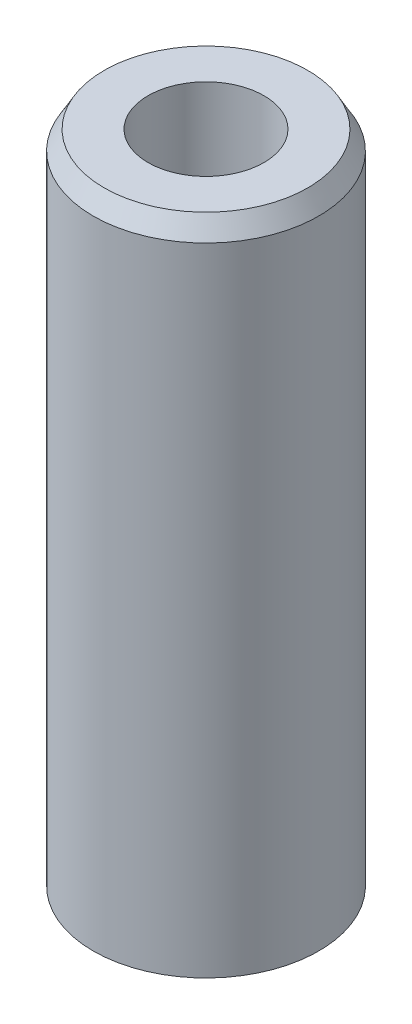
ISO-10303-21;
HEADER;
FILE_DESCRIPTION(('STEP AP214'),'2;1');
FILE_NAME('part.step','',(''),(''),'','','');
FILE_SCHEMA(('AUTOMOTIVE_DESIGN { 1 0 10303 214 1 1 1 1 }'));
ENDSEC;
DATA;
#1=APPLICATION_CONTEXT('core data for automotive mechanical design processes');
#2=APPLICATION_PROTOCOL_DEFINITION('international standard','automotive_design',2000,#1);
#3=PRODUCT_CONTEXT('',#1,'mechanical');
#4=PRODUCT('Part','Part','',(#3));
#5=PRODUCT_RELATED_PRODUCT_CATEGORY('part','',(#4));
#6=PRODUCT_DEFINITION_FORMATION('','',#4);
#7=PRODUCT_DEFINITION_CONTEXT('part definition',#1,'design');
#8=PRODUCT_DEFINITION('design','',#6,#7);
#9=PRODUCT_DEFINITION_SHAPE('','',#8);
#10=(LENGTH_UNIT() NAMED_UNIT(*) SI_UNIT(.MILLI.,.METRE.));
#11=(NAMED_UNIT(*) PLANE_ANGLE_UNIT() SI_UNIT($,.RADIAN.));
#12=(NAMED_UNIT(*) SI_UNIT($,.STERADIAN.) SOLID_ANGLE_UNIT());
#13=UNCERTAINTY_MEASURE_WITH_UNIT(LENGTH_MEASURE(1.E-05),#10,'distance_accuracy_value','');
#14=(GEOMETRIC_REPRESENTATION_CONTEXT(3) GLOBAL_UNCERTAINTY_ASSIGNED_CONTEXT((#13)) GLOBAL_UNIT_ASSIGNED_CONTEXT((#10,
#11,#12)) REPRESENTATION_CONTEXT('',''));
#15=CARTESIAN_POINT('',(0.,0.,0.));
#16=DIRECTION('',(0.,0.,1.));
#17=DIRECTION('',(1.,0.,0.));
#18=AXIS2_PLACEMENT_3D('',#15,#16,#17);
#19=CARTESIAN_POINT('',(0.,59.1041487479698,0.));
#20=DIRECTION('',(0.,-1.,0.));
#21=DIRECTION('',(0.,0.,-1.));
#22=AXIS2_PLACEMENT_3D('',#19,#20,#21);
#23=CYLINDRICAL_SURFACE('',#22,10.);
#24=CARTESIAN_POINT('',(0.,57.4228321711889,0.));
#25=DIRECTION('',(0.,1.,0.));
#26=DIRECTION('',(0.,0.,1.));
#27=AXIS2_PLACEMENT_3D('',#24,#25,#26);
#28=CIRCLE('',#27,10.);
#29=CARTESIAN_POINT('',(0.,57.4228321711889,10.));
#30=VERTEX_POINT('',#29);
#31=EDGE_CURVE('E50',#30,#30,#28,.F.);
#32=ORIENTED_EDGE('',*,*,#31,.T.);
#33=EDGE_LOOP('',(#32));
#34=FACE_BOUND('',#33,.T.);
#35=CARTESIAN_POINT('',(0.,0.970708578197428,0.));
#36=DIRECTION('',(0.,1.,0.));
#37=DIRECTION('',(0.,0.,1.));
#38=AXIS2_PLACEMENT_3D('',#35,#36,#37);
#39=CIRCLE('',#38,10.);
#40=CARTESIAN_POINT('',(0.,0.970708578197428,10.));
#41=VERTEX_POINT('',#40);
#42=EDGE_CURVE('E51',#41,#41,#39,.T.);
#43=ORIENTED_EDGE('',*,*,#42,.T.);
#44=EDGE_LOOP('',(#43));
#45=FACE_BOUND('',#44,.T.);
#46=ADVANCED_FACE('F39',(#34,#45),#23,.T.);
#47=CARTESIAN_POINT('',(0.,59.1041487479698,0.));
#48=DIRECTION('',(0.,1.,0.));
#49=DIRECTION('',(0.,0.,1.));
#50=AXIS2_PLACEMENT_3D('',#47,#48,#49);
#51=PLANE('',#50);
#52=CARTESIAN_POINT('',(0.,59.1041487479698,0.));
#53=DIRECTION('',(0.,1.,0.));
#54=DIRECTION('',(0.,0.,1.));
#55=AXIS2_PLACEMENT_3D('',#52,#53,#54);
#56=CIRCLE('',#55,9.02929142180256);
#57=CARTESIAN_POINT('',(0.,59.1041487479698,9.02929142180256));
#58=VERTEX_POINT('',#57);
#59=EDGE_CURVE('E54',#58,#58,#56,.T.);
#60=ORIENTED_EDGE('',*,*,#59,.T.);
#61=EDGE_LOOP('',(#60));
#62=FACE_BOUND('',#61,.T.);
#63=CARTESIAN_POINT('',(0.,59.1041487479698,0.));
#64=DIRECTION('',(0.,1.,0.));
#65=DIRECTION('',(0.,0.,1.));
#66=AXIS2_PLACEMENT_3D('',#63,#64,#65);
#67=CIRCLE('',#66,5.1433726205638);
#68=CARTESIAN_POINT('',(0.,59.1041487479698,5.1433726205638));
#69=VERTEX_POINT('',#68);
#70=EDGE_CURVE('E58',#69,#69,#67,.T.);
#71=ORIENTED_EDGE('',*,*,#70,.F.);
#72=EDGE_LOOP('',(#71));
#73=FACE_BOUND('',#72,.T.);
#74=ADVANCED_FACE('F69',(#62,#73),#51,.T.);
#75=CARTESIAN_POINT('',(0.,0.,0.));
#76=DIRECTION('',(0.,1.,0.));
#77=DIRECTION('',(0.,0.,1.));
#78=AXIS2_PLACEMENT_3D('',#75,#76,#77);
#79=PLANE('',#78);
#80=CARTESIAN_POINT('',(0.,0.,0.));
#81=DIRECTION('',(0.,1.,0.));
#82=DIRECTION('',(0.,0.,1.));
#83=AXIS2_PLACEMENT_3D('',#80,#81,#82);
#84=CIRCLE('',#83,8.3186834232191);
#85=CARTESIAN_POINT('',(0.,0.,8.3186834232191));
#86=VERTEX_POINT('',#85);
#87=EDGE_CURVE('E10',#86,#86,#84,.F.);
#88=ORIENTED_EDGE('',*,*,#87,.T.);
#89=EDGE_LOOP('',(#88));
#90=FACE_BOUND('',#89,.T.);
#91=CARTESIAN_POINT('',(0.,0.,0.));
#92=DIRECTION('',(0.,1.,0.));
#93=DIRECTION('',(0.,0.,1.));
#94=AXIS2_PLACEMENT_3D('',#91,#92,#93);
#95=CIRCLE('',#94,5.1433726205638);
#96=CARTESIAN_POINT('',(0.,0.,5.1433726205638));
#97=VERTEX_POINT('',#96);
#98=EDGE_CURVE('E63',#97,#97,#95,.T.);
#99=ORIENTED_EDGE('',*,*,#98,.T.);
#100=EDGE_LOOP('',(#99));
#101=FACE_BOUND('',#100,.T.);
#102=ADVANCED_FACE('F75',(#90,#101),#79,.F.);
#103=CARTESIAN_POINT('',(0.,59.1041487479698,0.));
#104=DIRECTION('',(0.,-1.,0.));
#105=DIRECTION('',(0.,0.,-1.));
#106=AXIS2_PLACEMENT_3D('',#103,#104,#105);
#107=CYLINDRICAL_SURFACE('',#106,5.1433726205638);
#108=ORIENTED_EDGE('',*,*,#70,.T.);
#109=EDGE_LOOP('',(#108));
#110=FACE_BOUND('',#109,.T.);
#111=ORIENTED_EDGE('',*,*,#98,.F.);
#112=EDGE_LOOP('',(#111));
#113=FACE_BOUND('',#112,.T.);
#114=ADVANCED_FACE('F70',(#110,#113),#107,.F.);
#115=CARTESIAN_POINT('',(0.,59.1041487479698,0.));
#116=DIRECTION('',(0.,-1.,0.));
#117=DIRECTION('',(0.,0.,-1.));
#118=AXIS2_PLACEMENT_3D('',#115,#116,#117);
#119=CONICAL_SURFACE('',#118,9.02929142180256,0.5235987755983);
#120=ORIENTED_EDGE('',*,*,#31,.F.);
#121=EDGE_LOOP('',(#120));
#122=FACE_BOUND('',#121,.T.);
#123=ORIENTED_EDGE('',*,*,#59,.F.);
#124=EDGE_LOOP('',(#123));
#125=FACE_BOUND('',#124,.T.);
#126=ADVANCED_FACE('F81',(#122,#125),#119,.T.);
#127=CARTESIAN_POINT('',(0.,0.970708578197428,0.));
#128=DIRECTION('',(0.,1.,0.));
#129=DIRECTION('',(0.,0.,1.));
#130=AXIS2_PLACEMENT_3D('',#127,#128,#129);
#131=CONICAL_SURFACE('',#130,10.,1.0471975511966);
#132=CARTESIAN_POINT('',(0.,0.,8.3186834232191));
#133=CARTESIAN_POINT('',(0.,0.0101115476895562,8.33619713756057));
#134=CARTESIAN_POINT('',(0.,0.0202230953791129,8.35371085190203));
#135=CARTESIAN_POINT('',(0.,0.0404461907582261,8.38873828058497));
#136=CARTESIAN_POINT('',(0.,0.0505577384477828,8.40625199492644));
#137=CARTESIAN_POINT('',(0.,0.0707808338268958,8.44127942360937));
#138=CARTESIAN_POINT('',(0.,0.0808923815164521,8.45879313795084));
#139=CARTESIAN_POINT('',(0.,0.101115476895565,8.49382056663378));
#140=CARTESIAN_POINT('',(0.,0.111227024585122,8.51133428097524));
#141=CARTESIAN_POINT('',(0.,0.131450119964235,8.54636170965818));
#142=CARTESIAN_POINT('',(0.,0.141561667653792,8.56387542399965));
#143=CARTESIAN_POINT('',(0.,0.161784763032905,8.59890285268258));
#144=CARTESIAN_POINT('',(0.,0.171896310722461,8.61641656702405));
#145=CARTESIAN_POINT('',(0.,0.192119406101574,8.65144399570699));
#146=CARTESIAN_POINT('',(0.,0.202230953791131,8.66895771004845));
#147=CARTESIAN_POINT('',(0.,0.222454049170244,8.70398513873139));
#148=CARTESIAN_POINT('',(0.,0.2325655968598,8.72149885307286));
#149=CARTESIAN_POINT('',(0.,0.252788692238913,8.75652628175579));
#150=CARTESIAN_POINT('',(0.,0.26290023992847,8.77403999609726));
#151=CARTESIAN_POINT('',(0.,0.283123335307583,8.8090674247802));
#152=CARTESIAN_POINT('',(0.,0.29323488299714,8.82658113912166));
#153=CARTESIAN_POINT('',(0.,0.313457978376253,8.8616085678046));
#154=CARTESIAN_POINT('',(0.,0.323569526065809,8.87912228214607));
#155=CARTESIAN_POINT('',(0.,0.343792621444922,8.914149710829));
#156=CARTESIAN_POINT('',(0.,0.353904169134479,8.93166342517047));
#157=CARTESIAN_POINT('',(0.,0.374127264513592,8.9666908538534));
#158=CARTESIAN_POINT('',(0.,0.384238812203149,8.98420456819487));
#159=CARTESIAN_POINT('',(0.,0.404461907582262,9.01923199687781));
#160=CARTESIAN_POINT('',(0.,0.414573455271818,9.03674571121928));
#161=CARTESIAN_POINT('',(0.,0.434796550650931,9.07177313990221));
#162=CARTESIAN_POINT('',(0.,0.444908098340488,9.08928685424368));
#163=CARTESIAN_POINT('',(0.,0.465131193719601,9.12431428292661));
#164=CARTESIAN_POINT('',(0.,0.475242741409158,9.14182799726808));
#165=CARTESIAN_POINT('',(0.,0.495465836788271,9.17685542595102));
#166=CARTESIAN_POINT('',(0.,0.505577384477827,9.19436914029249));
#167=CARTESIAN_POINT('',(0.,0.52580047985694,9.22939656897542));
#168=CARTESIAN_POINT('',(0.,0.535912027546497,9.24691028331689));
#169=CARTESIAN_POINT('',(0.,0.55613512292561,9.28193771199982));
#170=CARTESIAN_POINT('',(0.,0.566246670615166,9.29945142634129));
#171=CARTESIAN_POINT('',(0.,0.58646976599428,9.33447885502423));
#172=CARTESIAN_POINT('',(0.,0.596581313683836,9.35199256936569));
#173=CARTESIAN_POINT('',(0.,0.616804409062949,9.38701999804863));
#174=CARTESIAN_POINT('',(0.,0.626915956752506,9.4045337123901));
#175=CARTESIAN_POINT('',(0.,0.647139052131619,9.43956114107303));
#176=CARTESIAN_POINT('',(0.,0.657250599821175,9.4570748554145));
#177=CARTESIAN_POINT('',(0.,0.677473695200288,9.49210228409744));
#178=CARTESIAN_POINT('',(0.,0.687585242889845,9.5096159984389));
#179=CARTESIAN_POINT('',(0.,0.707808338268958,9.54464342712184));
#180=CARTESIAN_POINT('',(0.,0.717919885958515,9.56215714146331));
#181=CARTESIAN_POINT('',(0.,0.738142981337628,9.59718457014624));
#182=CARTESIAN_POINT('',(0.,0.748254529027184,9.61469828448771));
#183=CARTESIAN_POINT('',(0.,0.768477624406297,9.64972571317065));
#184=CARTESIAN_POINT('',(0.,0.778589172095854,9.66723942751211));
#185=CARTESIAN_POINT('',(0.,0.798812267474967,9.70226685619505));
#186=CARTESIAN_POINT('',(0.,0.808923815164523,9.71978057053652));
#187=CARTESIAN_POINT('',(0.,0.829146910543637,9.75480799921945));
#188=CARTESIAN_POINT('',(0.,0.839258458233193,9.77232171356092));
#189=CARTESIAN_POINT('',(0.,0.859481553612306,9.80734914224386));
#190=CARTESIAN_POINT('',(0.,0.869593101301863,9.82486285658532));
#191=CARTESIAN_POINT('',(0.,0.889816196680976,9.85989028526826));
#192=CARTESIAN_POINT('',(0.,0.899927744370532,9.87740399960973));
#193=CARTESIAN_POINT('',(0.,0.920150839749645,9.91243142829266));
#194=CARTESIAN_POINT('',(0.,0.930262387439202,9.92994514263413));
#195=CARTESIAN_POINT('',(0.,0.950485482818315,9.96497257131707));
#196=CARTESIAN_POINT('',(0.,0.960597030507872,9.98248628565853));
#197=CARTESIAN_POINT('',(0.,0.970708578197428,10.));
#198=B_SPLINE_CURVE_WITH_KNOTS('',3,(#132,#133,#134,#135,#136,#137,#138,#139,#140,#141,#142,
#143,#144,#145,#146,#147,#148,#149,#150,#151,#152,#153,#154,#155,#156,#157,#158,#159,#160,#161,
#162,#163,#164,#165,#166,#167,#168,#169,#170,#171,#172,#173,#174,#175,#176,#177,#178,#179,#180,
#181,#182,#183,#184,#185,#186,#187,#188,#189,#190,#191,#192,#193,#194,#195,#196,#197),
.UNSPECIFIED.,.F.,.F.,(4,2,2,2,2,2,2,2,2,2,2,2,2,2,2,2,2,2,2,2,2,2,2,2,2,2,2,2,2,2,2,2,4),(0.,
0.0606692861373392,0.121338572274678,0.182007858412019,0.242677144549358,0.303346430686697,
0.364015716824036,0.424685002961376,0.485354289098716,0.546023575236055,0.606692861373395,
0.667362147510734,0.728031433648073,0.788700719785414,0.849370005922753,0.910039292060092,
0.970708578197431,1.03137786433477,1.09204715047211,1.15271643660945,1.21338572274679,
1.27405500888413,1.33472429502147,1.39539358115881,1.45606286729615,1.51673215343349,
1.57740143957083,1.63807072570817,1.69874001184551,1.75940929798285,1.82007858412019,
1.88074787025753,1.94141715639487),.UNSPECIFIED.);
#199=EDGE_CURVE('BSEAM45',#86,#41,#198,.T.);
#200=ORIENTED_EDGE('',*,*,#87,.F.);
#201=ORIENTED_EDGE('',*,*,#42,.F.);
#202=ORIENTED_EDGE('',*,*,#199,.T.);
#203=ORIENTED_EDGE('',*,*,#199,.F.);
#204=EDGE_LOOP('',(#200,#202,#201,#203));
#205=FACE_BOUND('',#204,.T.);
#206=ADVANCED_FACE('F45',(#205),#131,.T.);
#207=CLOSED_SHELL('',(#46,#74,#102,#114,#126,#206));
#208=MANIFOLD_SOLID_BREP('B2',#207);
#209=ADVANCED_BREP_SHAPE_REPRESENTATION('',(#18,#208),#14);
#210=SHAPE_DEFINITION_REPRESENTATION(#9,#209);
ENDSEC;
END-ISO-10303-21;
